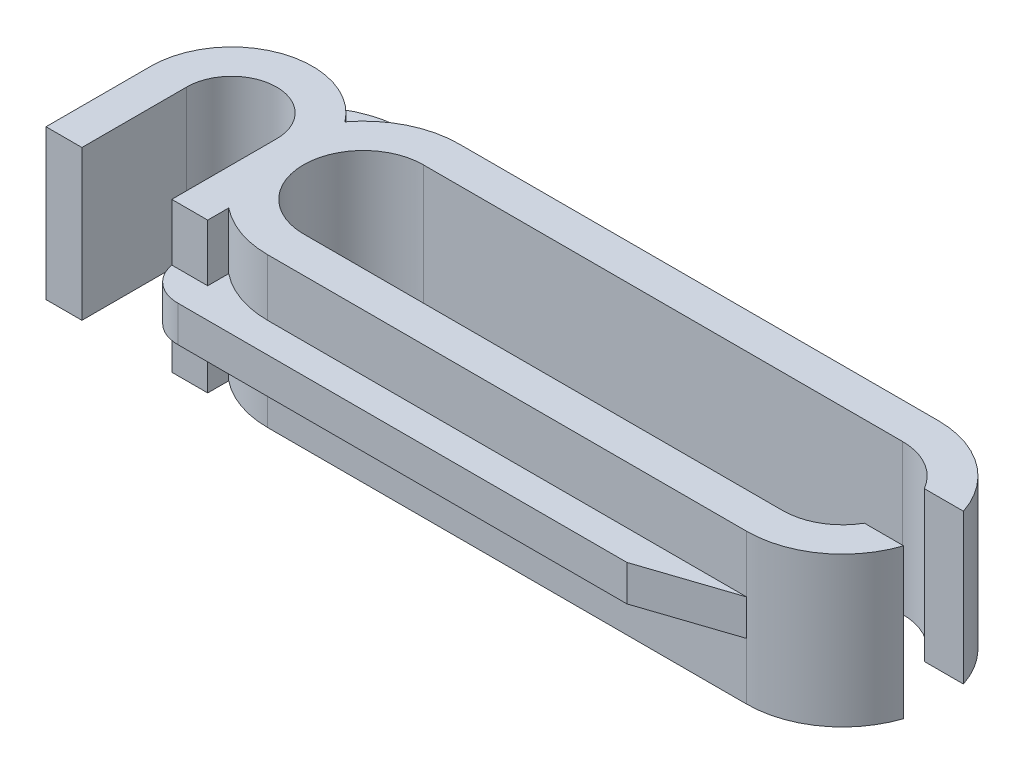
ISO-10303-21;
HEADER;
FILE_DESCRIPTION(('STEP AP214'),'2;1');
FILE_NAME('part.step','',(''),(''),'','','');
FILE_SCHEMA(('AUTOMOTIVE_DESIGN { 1 0 10303 214 1 1 1 1 }'));
ENDSEC;
DATA;
#1=APPLICATION_CONTEXT('core data for automotive mechanical design processes');
#2=APPLICATION_PROTOCOL_DEFINITION('international standard','automotive_design',2000,#1);
#3=PRODUCT_CONTEXT('',#1,'mechanical');
#4=PRODUCT('Part','Part','',(#3));
#5=PRODUCT_RELATED_PRODUCT_CATEGORY('part','',(#4));
#6=PRODUCT_DEFINITION_FORMATION('','',#4);
#7=PRODUCT_DEFINITION_CONTEXT('part definition',#1,'design');
#8=PRODUCT_DEFINITION('design','',#6,#7);
#9=PRODUCT_DEFINITION_SHAPE('','',#8);
#10=(LENGTH_UNIT() NAMED_UNIT(*) SI_UNIT(.MILLI.,.METRE.));
#11=(NAMED_UNIT(*) PLANE_ANGLE_UNIT() SI_UNIT($,.RADIAN.));
#12=(NAMED_UNIT(*) SI_UNIT($,.STERADIAN.) SOLID_ANGLE_UNIT());
#13=UNCERTAINTY_MEASURE_WITH_UNIT(LENGTH_MEASURE(1.E-05),#10,'distance_accuracy_value','');
#14=(GEOMETRIC_REPRESENTATION_CONTEXT(3) GLOBAL_UNCERTAINTY_ASSIGNED_CONTEXT((#13)) GLOBAL_UNIT_ASSIGNED_CONTEXT((#10,
#11,#12)) REPRESENTATION_CONTEXT('',''));
#15=CARTESIAN_POINT('',(0.,0.,0.));
#16=DIRECTION('',(0.,0.,1.));
#17=DIRECTION('',(1.,0.,0.));
#18=AXIS2_PLACEMENT_3D('',#15,#16,#17);
#19=CARTESIAN_POINT('',(-8.,5.,0.));
#20=DIRECTION('',(0.,-1.,0.));
#21=DIRECTION('',(0.,0.,-1.));
#22=AXIS2_PLACEMENT_3D('',#19,#20,#21);
#23=CYLINDRICAL_SURFACE('',#22,3.2);
#24=CARTESIAN_POINT('',(-8.,3.1,0.));
#25=DIRECTION('',(0.,-1.,0.));
#26=DIRECTION('',(0.,0.,-1.));
#27=AXIS2_PLACEMENT_3D('',#24,#25,#26);
#28=CIRCLE('',#27,3.2);
#29=CARTESIAN_POINT('',(-8.,3.1,3.2));
#30=VERTEX_POINT('',#29);
#31=CARTESIAN_POINT('',(-10.,3.1,2.49799919935936));
#32=VERTEX_POINT('',#31);
#33=EDGE_CURVE('E66',#30,#32,#28,.T.);
#34=ORIENTED_EDGE('',*,*,#33,.F.);
#35=DIRECTION('',(0.,-1.,0.));
#36=VECTOR('',#35,1.);
#37=CARTESIAN_POINT('',(-8.,5.,3.2));
#38=LINE('',#37,#36);
#39=CARTESIAN_POINT('',(-8.,5.,3.2));
#40=VERTEX_POINT('',#39);
#41=EDGE_CURVE('E513',#40,#30,#38,.T.);
#42=ORIENTED_EDGE('',*,*,#41,.F.);
#43=CARTESIAN_POINT('',(-8.,5.,0.));
#44=DIRECTION('',(0.,1.,0.));
#45=DIRECTION('',(0.,0.,1.));
#46=AXIS2_PLACEMENT_3D('',#43,#44,#45);
#47=CIRCLE('',#46,3.2);
#48=CARTESIAN_POINT('',(-10.,5.,2.49799919935936));
#49=VERTEX_POINT('',#48);
#50=EDGE_CURVE('E480',#49,#40,#47,.T.);
#51=ORIENTED_EDGE('',*,*,#50,.F.);
#52=DIRECTION('',(0.,-1.,0.));
#53=VECTOR('',#52,1.);
#54=CARTESIAN_POINT('',(-10.,5.,2.49799919935936));
#55=LINE('',#54,#53);
#56=EDGE_CURVE('E419',#49,#32,#55,.T.);
#57=ORIENTED_EDGE('',*,*,#56,.T.);
#58=EDGE_LOOP('',(#34,#42,#51,#57));
#59=FACE_BOUND('',#58,.T.);
#60=ADVANCED_FACE('F43',(#59),#23,.T.);
#61=CARTESIAN_POINT('',(8.,5.,3.2));
#62=DIRECTION('',(0.,0.,-1.));
#63=DIRECTION('',(-1.,0.,0.));
#64=AXIS2_PLACEMENT_3D('',#61,#62,#63);
#65=PLANE('',#64);
#66=DIRECTION('',(-1.,0.,0.));
#67=VECTOR('',#66,1.);
#68=CARTESIAN_POINT('',(-8.,3.1,3.2));
#69=LINE('',#68,#67);
#70=CARTESIAN_POINT('',(8.,3.1,3.2));
#71=VERTEX_POINT('',#70);
#72=EDGE_CURVE('E293',#71,#30,#69,.T.);
#73=ORIENTED_EDGE('',*,*,#72,.F.);
#74=DIRECTION('',(0.,-1.,0.));
#75=VECTOR('',#74,1.);
#76=CARTESIAN_POINT('',(8.,5.,3.2));
#77=LINE('',#76,#75);
#78=CARTESIAN_POINT('',(8.,5.,3.2));
#79=VERTEX_POINT('',#78);
#80=EDGE_CURVE('E509',#79,#71,#77,.T.);
#81=ORIENTED_EDGE('',*,*,#80,.F.);
#82=DIRECTION('',(1.,0.,0.));
#83=VECTOR('',#82,1.);
#84=CARTESIAN_POINT('',(8.,5.,3.2));
#85=LINE('',#84,#83);
#86=EDGE_CURVE('E479',#40,#79,#85,.T.);
#87=ORIENTED_EDGE('',*,*,#86,.F.);
#88=ORIENTED_EDGE('',*,*,#41,.T.);
#89=EDGE_LOOP('',(#73,#81,#87,#88));
#90=FACE_BOUND('',#89,.T.);
#91=ADVANCED_FACE('F593',(#90),#65,.F.);
#92=CARTESIAN_POINT('',(-10.,5.,-0.3));
#93=DIRECTION('',(1.,0.,0.));
#94=DIRECTION('',(0.,0.,-1.));
#95=AXIS2_PLACEMENT_3D('',#92,#93,#94);
#96=PLANE('',#95);
#97=DIRECTION('',(0.,-1.,0.));
#98=VECTOR('',#97,1.);
#99=CARTESIAN_POINT('',(-10.,5.,3.2));
#100=LINE('',#99,#98);
#101=CARTESIAN_POINT('',(-10.,5.,3.2));
#102=VERTEX_POINT('',#101);
#103=CARTESIAN_POINT('',(-10.,3.1,3.2));
#104=VERTEX_POINT('',#103);
#105=EDGE_CURVE('E410',#102,#104,#100,.T.);
#106=ORIENTED_EDGE('',*,*,#105,.T.);
#107=DIRECTION('',(0.,0.,1.));
#108=VECTOR('',#107,1.);
#109=CARTESIAN_POINT('',(-10.,3.1,3.2));
#110=LINE('',#109,#108);
#111=EDGE_CURVE('E587',#32,#104,#110,.T.);
#112=ORIENTED_EDGE('',*,*,#111,.F.);
#113=ORIENTED_EDGE('',*,*,#56,.F.);
#114=DIRECTION('',(0.,0.,1.));
#115=VECTOR('',#114,1.);
#116=CARTESIAN_POINT('',(-10.,5.,-0.3));
#117=LINE('',#116,#115);
#118=EDGE_CURVE('E395',#49,#102,#117,.T.);
#119=ORIENTED_EDGE('',*,*,#118,.T.);
#120=EDGE_LOOP('',(#106,#112,#113,#119));
#121=FACE_BOUND('',#120,.T.);
#122=ADVANCED_FACE('F585',(#121),#96,.T.);
#123=CARTESIAN_POINT('',(-10.,5.,3.2));
#124=DIRECTION('',(0.,0.,1.));
#125=DIRECTION('',(1.,0.,0.));
#126=AXIS2_PLACEMENT_3D('',#123,#124,#125);
#127=PLANE('',#126);
#128=DIRECTION('',(0.,-1.,0.));
#129=VECTOR('',#128,1.);
#130=CARTESIAN_POINT('',(-11.2,5.,3.2));
#131=LINE('',#130,#129);
#132=CARTESIAN_POINT('',(-11.2,5.,3.2));
#133=VERTEX_POINT('',#132);
#134=CARTESIAN_POINT('',(-11.2,3.1,3.2));
#135=VERTEX_POINT('',#134);
#136=EDGE_CURVE('E380',#133,#135,#131,.T.);
#137=ORIENTED_EDGE('',*,*,#136,.T.);
#138=DIRECTION('',(-1.,0.,0.));
#139=VECTOR('',#138,1.);
#140=CARTESIAN_POINT('',(-11.2,3.1,3.2));
#141=LINE('',#140,#139);
#142=EDGE_CURVE('E274',#104,#135,#141,.T.);
#143=ORIENTED_EDGE('',*,*,#142,.F.);
#144=ORIENTED_EDGE('',*,*,#105,.F.);
#145=DIRECTION('',(-1.,0.,0.));
#146=VECTOR('',#145,1.);
#147=CARTESIAN_POINT('',(-10.,5.,3.2));
#148=LINE('',#147,#146);
#149=EDGE_CURVE('E385',#102,#133,#148,.T.);
#150=ORIENTED_EDGE('',*,*,#149,.T.);
#151=EDGE_LOOP('',(#137,#143,#144,#150));
#152=FACE_BOUND('',#151,.T.);
#153=ADVANCED_FACE('F583',(#152),#127,.T.);
#154=CARTESIAN_POINT('',(-8.,1.9,0.));
#155=DIRECTION('',(0.,-1.,0.));
#156=DIRECTION('',(0.,0.,1.));
#157=AXIS2_PLACEMENT_3D('',#154,#155,#156);
#158=CIRCLE('',#157,3.2);
#159=CARTESIAN_POINT('',(-10.5500050071212,1.9,-1.93325488843475));
#160=VERTEX_POINT('',#159);
#161=CARTESIAN_POINT('',(-8.,1.9,-3.2));
#162=VERTEX_POINT('',#161);
#163=EDGE_CURVE('E335',#160,#162,#158,.T.);
#164=ORIENTED_EDGE('',*,*,#163,.T.);
#165=DIRECTION('',(0.,-1.,0.));
#166=VECTOR('',#165,1.);
#167=CARTESIAN_POINT('',(-8.,5.,-3.2));
#168=LINE('',#167,#166);
#169=CARTESIAN_POINT('',(-8.,0.,-3.2));
#170=VERTEX_POINT('',#169);
#171=EDGE_CURVE('E488',#162,#170,#168,.T.);
#172=ORIENTED_EDGE('',*,*,#171,.T.);
#173=CARTESIAN_POINT('',(-8.,0.,0.));
#174=DIRECTION('',(0.,1.,0.));
#175=DIRECTION('',(0.,0.,1.));
#176=AXIS2_PLACEMENT_3D('',#173,#174,#175);
#177=CIRCLE('',#176,3.2);
#178=CARTESIAN_POINT('',(-10.5500050071212,0.,-1.93325488843475));
#179=VERTEX_POINT('',#178);
#180=EDGE_CURVE('E489',#170,#179,#177,.T.);
#181=ORIENTED_EDGE('',*,*,#180,.T.);
#182=DIRECTION('',(0.,-1.,0.));
#183=VECTOR('',#182,1.);
#184=CARTESIAN_POINT('',(-10.5500050071212,2.5,-1.93325488843475));
#185=LINE('',#184,#183);
#186=EDGE_CURVE('E422',#179,#160,#185,.F.);
#187=ORIENTED_EDGE('',*,*,#186,.T.);
#188=EDGE_LOOP('',(#164,#172,#181,#187));
#189=FACE_BOUND('',#188,.T.);
#190=ADVANCED_FACE('F601',(#189),#23,.T.);
#191=CARTESIAN_POINT('',(-8.,5.,-3.2));
#192=DIRECTION('',(0.,0.,1.));
#193=DIRECTION('',(1.,0.,0.));
#194=AXIS2_PLACEMENT_3D('',#191,#192,#193);
#195=PLANE('',#194);
#196=DIRECTION('',(1.,0.,0.));
#197=VECTOR('',#196,1.);
#198=CARTESIAN_POINT('',(8.,1.9,-3.2));
#199=LINE('',#198,#197);
#200=CARTESIAN_POINT('',(8.,1.9,-3.2));
#201=VERTEX_POINT('',#200);
#202=EDGE_CURVE('E338',#162,#201,#199,.T.);
#203=ORIENTED_EDGE('',*,*,#202,.T.);
#204=DIRECTION('',(0.,-1.,0.));
#205=VECTOR('',#204,1.);
#206=CARTESIAN_POINT('',(8.,5.,-3.2));
#207=LINE('',#206,#205);
#208=CARTESIAN_POINT('',(8.,0.,-3.2));
#209=VERTEX_POINT('',#208);
#210=EDGE_CURVE('E504',#201,#209,#207,.T.);
#211=ORIENTED_EDGE('',*,*,#210,.T.);
#212=DIRECTION('',(-1.,0.,0.));
#213=VECTOR('',#212,1.);
#214=CARTESIAN_POINT('',(-8.,0.,-3.2));
#215=LINE('',#214,#213);
#216=EDGE_CURVE('E498',#209,#170,#215,.T.);
#217=ORIENTED_EDGE('',*,*,#216,.T.);
#218=ORIENTED_EDGE('',*,*,#171,.F.);
#219=EDGE_LOOP('',(#203,#211,#217,#218));
#220=FACE_BOUND('',#219,.T.);
#221=ADVANCED_FACE('F607',(#220),#195,.F.);
#222=DIRECTION('',(0.,-1.,0.));
#223=VECTOR('',#222,1.);
#224=CARTESIAN_POINT('',(-14.2,5.,3.2));
#225=LINE('',#224,#223);
#226=CARTESIAN_POINT('',(-14.2,5.,3.2));
#227=VERTEX_POINT('',#226);
#228=CARTESIAN_POINT('',(-14.2,0.,3.2));
#229=VERTEX_POINT('',#228);
#230=EDGE_CURVE('E378',#227,#229,#225,.T.);
#231=ORIENTED_EDGE('',*,*,#230,.F.);
#232=CARTESIAN_POINT('',(-15.4,5.,3.2));
#233=VERTEX_POINT('',#232);
#234=EDGE_CURVE('E389',#227,#233,#148,.T.);
#235=ORIENTED_EDGE('',*,*,#234,.T.);
#236=DIRECTION('',(0.,-1.,0.));
#237=VECTOR('',#236,1.);
#238=CARTESIAN_POINT('',(-15.4,5.,3.2));
#239=LINE('',#238,#237);
#240=CARTESIAN_POINT('',(-15.4,0.,3.2));
#241=VERTEX_POINT('',#240);
#242=EDGE_CURVE('E397',#233,#241,#239,.T.);
#243=ORIENTED_EDGE('',*,*,#242,.T.);
#244=DIRECTION('',(-1.,0.,0.));
#245=VECTOR('',#244,1.);
#246=CARTESIAN_POINT('',(-10.,0.,3.2));
#247=LINE('',#246,#245);
#248=EDGE_CURVE('E377',#229,#241,#247,.T.);
#249=ORIENTED_EDGE('',*,*,#248,.F.);
#250=EDGE_LOOP('',(#231,#235,#243,#249));
#251=FACE_BOUND('',#250,.T.);
#252=ADVANCED_FACE('F568',(#251),#127,.T.);
#253=CARTESIAN_POINT('',(-8.,1.9,3.2));
#254=VERTEX_POINT('',#253);
#255=CARTESIAN_POINT('',(-8.,0.,3.2));
#256=VERTEX_POINT('',#255);
#257=EDGE_CURVE('E512',#254,#256,#38,.T.);
#258=ORIENTED_EDGE('',*,*,#257,.F.);
#259=CARTESIAN_POINT('',(-8.,1.9,0.));
#260=DIRECTION('',(0.,-1.,0.));
#261=DIRECTION('',(0.,0.,-1.));
#262=AXIS2_PLACEMENT_3D('',#259,#260,#261);
#263=CIRCLE('',#262,3.2);
#264=CARTESIAN_POINT('',(-10.,1.9,2.49799919935936));
#265=VERTEX_POINT('',#264);
#266=EDGE_CURVE('E300',#254,#265,#263,.T.);
#267=ORIENTED_EDGE('',*,*,#266,.T.);
#268=CARTESIAN_POINT('',(-10.,0.,2.49799919935936));
#269=VERTEX_POINT('',#268);
#270=EDGE_CURVE('E413',#265,#269,#55,.T.);
#271=ORIENTED_EDGE('',*,*,#270,.T.);
#272=EDGE_CURVE('E468',#269,#256,#177,.T.);
#273=ORIENTED_EDGE('',*,*,#272,.T.);
#274=EDGE_LOOP('',(#258,#267,#271,#273));
#275=FACE_BOUND('',#274,.T.);
#276=ADVANCED_FACE('F609',(#275),#23,.T.);
#277=CARTESIAN_POINT('',(8.,5.,0.));
#278=DIRECTION('',(0.,-1.,0.));
#279=DIRECTION('',(0.,0.,-1.));
#280=AXIS2_PLACEMENT_3D('',#277,#278,#279);
#281=CYLINDRICAL_SURFACE('',#280,3.2);
#282=CARTESIAN_POINT('',(8.,0.,0.));
#283=DIRECTION('',(0.,1.,0.));
#284=DIRECTION('',(0.,0.,-1.));
#285=AXIS2_PLACEMENT_3D('',#282,#283,#284);
#286=CIRCLE('',#285,3.2);
#287=CARTESIAN_POINT('',(8.,0.,3.2));
#288=VERTEX_POINT('',#287);
#289=CARTESIAN_POINT('',(11.0397368307141,0.,1.));
#290=VERTEX_POINT('',#289);
#291=EDGE_CURVE('E495',#288,#290,#286,.T.);
#292=ORIENTED_EDGE('',*,*,#291,.T.);
#293=DIRECTION('',(0.,-1.,0.));
#294=VECTOR('',#293,1.);
#295=CARTESIAN_POINT('',(11.0397368307141,5.,1.));
#296=LINE('',#295,#294);
#297=CARTESIAN_POINT('',(11.0397368307141,5.,1.));
#298=VERTEX_POINT('',#297);
#299=EDGE_CURVE('E438',#290,#298,#296,.F.);
#300=ORIENTED_EDGE('',*,*,#299,.T.);
#301=CARTESIAN_POINT('',(8.,5.,0.));
#302=DIRECTION('',(0.,1.,0.));
#303=DIRECTION('',(0.,0.,-1.));
#304=AXIS2_PLACEMENT_3D('',#301,#302,#303);
#305=CIRCLE('',#304,3.2);
#306=EDGE_CURVE('E483',#79,#298,#305,.T.);
#307=ORIENTED_EDGE('',*,*,#306,.F.);
#308=ORIENTED_EDGE('',*,*,#80,.T.);
#309=DIRECTION('',(0.,-1.,0.));
#310=VECTOR('',#309,1.);
#311=CARTESIAN_POINT('',(8.,3.1,3.2));
#312=LINE('',#311,#310);
#313=CARTESIAN_POINT('',(8.,1.9,3.2));
#314=VERTEX_POINT('',#313);
#315=EDGE_CURVE('E299',#71,#314,#312,.T.);
#316=ORIENTED_EDGE('',*,*,#315,.T.);
#317=EDGE_CURVE('E508',#314,#288,#77,.T.);
#318=ORIENTED_EDGE('',*,*,#317,.T.);
#319=EDGE_LOOP('',(#292,#300,#307,#308,#316,#318));
#320=FACE_BOUND('',#319,.T.);
#321=ADVANCED_FACE('F597',(#320),#281,.T.);
#322=CARTESIAN_POINT('',(8.,0.,0.));
#323=DIRECTION('',(0.,1.,0.));
#324=DIRECTION('',(0.,0.,1.));
#325=AXIS2_PLACEMENT_3D('',#322,#323,#324);
#326=CYLINDRICAL_SURFACE('',#325,2.);
#327=CARTESIAN_POINT('',(8.,5.,0.));
#328=DIRECTION('',(0.,1.,0.));
#329=DIRECTION('',(0.,0.,-1.));
#330=AXIS2_PLACEMENT_3D('',#327,#328,#329);
#331=CIRCLE('',#330,2.);
#332=CARTESIAN_POINT('',(8.,5.,2.));
#333=VERTEX_POINT('',#332);
#334=CARTESIAN_POINT('',(9.73205080756888,5.,1.));
#335=VERTEX_POINT('',#334);
#336=EDGE_CURVE('E461',#333,#335,#331,.T.);
#337=ORIENTED_EDGE('',*,*,#336,.T.);
#338=DIRECTION('',(0.,1.,0.));
#339=VECTOR('',#338,1.);
#340=CARTESIAN_POINT('',(9.73205080756888,0.,1.));
#341=LINE('',#340,#339);
#342=CARTESIAN_POINT('',(9.73205080756888,0.,1.));
#343=VERTEX_POINT('',#342);
#344=EDGE_CURVE('E11',#335,#343,#341,.F.);
#345=ORIENTED_EDGE('',*,*,#344,.T.);
#346=CARTESIAN_POINT('',(8.,0.,0.));
#347=DIRECTION('',(0.,1.,0.));
#348=DIRECTION('',(0.,0.,-1.));
#349=AXIS2_PLACEMENT_3D('',#346,#347,#348);
#350=CIRCLE('',#349,2.);
#351=CARTESIAN_POINT('',(8.,0.,2.));
#352=VERTEX_POINT('',#351);
#353=EDGE_CURVE('E449',#352,#343,#350,.T.);
#354=ORIENTED_EDGE('',*,*,#353,.F.);
#355=DIRECTION('',(0.,1.,0.));
#356=VECTOR('',#355,1.);
#357=CARTESIAN_POINT('',(8.,0.,2.));
#358=LINE('',#357,#356);
#359=EDGE_CURVE('E472',#352,#333,#358,.T.);
#360=ORIENTED_EDGE('',*,*,#359,.T.);
#361=EDGE_LOOP('',(#337,#345,#354,#360));
#362=FACE_BOUND('',#361,.T.);
#363=ADVANCED_FACE('F611',(#362),#326,.F.);
#364=CARTESIAN_POINT('',(-8.,5.,-3.2));
#365=VERTEX_POINT('',#364);
#366=CARTESIAN_POINT('',(-8.,3.1,-3.2));
#367=VERTEX_POINT('',#366);
#368=EDGE_CURVE('E501',#365,#367,#168,.T.);
#369=ORIENTED_EDGE('',*,*,#368,.T.);
#370=CARTESIAN_POINT('',(-8.,3.1,0.));
#371=DIRECTION('',(0.,-1.,0.));
#372=DIRECTION('',(0.,0.,1.));
#373=AXIS2_PLACEMENT_3D('',#370,#371,#372);
#374=CIRCLE('',#373,3.2);
#375=CARTESIAN_POINT('',(-10.5500050071212,3.1,-1.93325488843476));
#376=VERTEX_POINT('',#375);
#377=EDGE_CURVE('E321',#376,#367,#374,.T.);
#378=ORIENTED_EDGE('',*,*,#377,.F.);
#379=CARTESIAN_POINT('',(-10.5500050071212,5.,-1.93325488843475));
#380=VERTEX_POINT('',#379);
#381=EDGE_CURVE('E421',#376,#380,#185,.F.);
#382=ORIENTED_EDGE('',*,*,#381,.T.);
#383=EDGE_CURVE('E476',#365,#380,#47,.T.);
#384=ORIENTED_EDGE('',*,*,#383,.F.);
#385=EDGE_LOOP('',(#369,#378,#382,#384));
#386=FACE_BOUND('',#385,.T.);
#387=ADVANCED_FACE('F45',(#386),#23,.T.);
#388=ORIENTED_EDGE('',*,*,#317,.F.);
#389=DIRECTION('',(-1.,0.,0.));
#390=VECTOR('',#389,1.);
#391=CARTESIAN_POINT('',(-8.,1.9,3.2));
#392=LINE('',#391,#390);
#393=EDGE_CURVE('E58',#314,#254,#392,.T.);
#394=ORIENTED_EDGE('',*,*,#393,.T.);
#395=ORIENTED_EDGE('',*,*,#257,.T.);
#396=DIRECTION('',(1.,0.,0.));
#397=VECTOR('',#396,1.);
#398=CARTESIAN_POINT('',(8.,0.,3.2));
#399=LINE('',#398,#397);
#400=EDGE_CURVE('E491',#256,#288,#399,.T.);
#401=ORIENTED_EDGE('',*,*,#400,.T.);
#402=EDGE_LOOP('',(#388,#394,#395,#401));
#403=FACE_BOUND('',#402,.T.);
#404=ADVANCED_FACE('F605',(#403),#65,.F.);
#405=CARTESIAN_POINT('',(11.0397368307141,5.,-1.));
#406=VERTEX_POINT('',#405);
#407=CARTESIAN_POINT('',(8.,5.,-3.2));
#408=VERTEX_POINT('',#407);
#409=EDGE_CURVE('E482',#406,#408,#305,.T.);
#410=ORIENTED_EDGE('',*,*,#409,.F.);
#411=DIRECTION('',(0.,-1.,0.));
#412=VECTOR('',#411,1.);
#413=CARTESIAN_POINT('',(11.0397368307141,5.,-1.));
#414=LINE('',#413,#412);
#415=CARTESIAN_POINT('',(11.0397368307141,0.,-1.));
#416=VERTEX_POINT('',#415);
#417=EDGE_CURVE('E433',#406,#416,#414,.T.);
#418=ORIENTED_EDGE('',*,*,#417,.T.);
#419=EDGE_CURVE('E494',#416,#209,#286,.T.);
#420=ORIENTED_EDGE('',*,*,#419,.T.);
#421=ORIENTED_EDGE('',*,*,#210,.F.);
#422=DIRECTION('',(0.,-1.,0.));
#423=VECTOR('',#422,1.);
#424=CARTESIAN_POINT('',(8.,3.1,-3.2));
#425=LINE('',#424,#423);
#426=CARTESIAN_POINT('',(8.,3.1,-3.2));
#427=VERTEX_POINT('',#426);
#428=EDGE_CURVE('E354',#427,#201,#425,.T.);
#429=ORIENTED_EDGE('',*,*,#428,.F.);
#430=EDGE_CURVE('E505',#408,#427,#207,.T.);
#431=ORIENTED_EDGE('',*,*,#430,.F.);
#432=EDGE_LOOP('',(#410,#418,#420,#421,#429,#431));
#433=FACE_BOUND('',#432,.T.);
#434=ADVANCED_FACE('F541',(#433),#281,.T.);
#435=ORIENTED_EDGE('',*,*,#430,.T.);
#436=DIRECTION('',(1.,0.,0.));
#437=VECTOR('',#436,1.);
#438=CARTESIAN_POINT('',(8.,3.1,-3.2));
#439=LINE('',#438,#437);
#440=EDGE_CURVE('E324',#367,#427,#439,.T.);
#441=ORIENTED_EDGE('',*,*,#440,.F.);
#442=ORIENTED_EDGE('',*,*,#368,.F.);
#443=DIRECTION('',(-1.,0.,0.));
#444=VECTOR('',#443,1.);
#445=CARTESIAN_POINT('',(-8.,5.,-3.2));
#446=LINE('',#445,#444);
#447=EDGE_CURVE('E486',#408,#365,#446,.T.);
#448=ORIENTED_EDGE('',*,*,#447,.F.);
#449=EDGE_LOOP('',(#435,#441,#442,#448));
#450=FACE_BOUND('',#449,.T.);
#451=ADVANCED_FACE('F551',(#450),#195,.F.);
#452=CARTESIAN_POINT('',(-8.,5.,0.));
#453=DIRECTION('',(0.,1.,0.));
#454=DIRECTION('',(0.,0.,1.));
#455=AXIS2_PLACEMENT_3D('',#452,#453,#454);
#456=PLANE('',#455);
#457=DIRECTION('',(0.,0.,-1.));
#458=VECTOR('',#457,1.);
#459=CARTESIAN_POINT('',(-14.2,5.,-0.3));
#460=LINE('',#459,#458);
#461=CARTESIAN_POINT('',(-14.2,5.,-0.3));
#462=VERTEX_POINT('',#461);
#463=EDGE_CURVE('E364',#227,#462,#460,.T.);
#464=ORIENTED_EDGE('',*,*,#463,.T.);
#465=CARTESIAN_POINT('',(-12.7,5.,-0.3));
#466=DIRECTION('',(0.,-1.,0.));
#467=DIRECTION('',(0.,0.,1.));
#468=AXIS2_PLACEMENT_3D('',#465,#466,#467);
#469=CIRCLE('',#468,1.5);
#470=CARTESIAN_POINT('',(-11.2,5.,-0.3));
#471=VERTEX_POINT('',#470);
#472=EDGE_CURVE('E357',#462,#471,#469,.T.);
#473=ORIENTED_EDGE('',*,*,#472,.T.);
#474=DIRECTION('',(0.,0.,1.));
#475=VECTOR('',#474,1.);
#476=CARTESIAN_POINT('',(-11.2,5.,-0.3));
#477=LINE('',#476,#475);
#478=EDGE_CURVE('E360',#471,#133,#477,.T.);
#479=ORIENTED_EDGE('',*,*,#478,.T.);
#480=ORIENTED_EDGE('',*,*,#149,.F.);
#481=ORIENTED_EDGE('',*,*,#118,.F.);
#482=ORIENTED_EDGE('',*,*,#50,.T.);
#483=ORIENTED_EDGE('',*,*,#86,.T.);
#484=ORIENTED_EDGE('',*,*,#306,.T.);
#485=DIRECTION('',(1.,0.,0.));
#486=VECTOR('',#485,1.);
#487=CARTESIAN_POINT('',(8.5,5.,1.));
#488=LINE('',#487,#486);
#489=EDGE_CURVE('E425',#335,#298,#488,.T.);
#490=ORIENTED_EDGE('',*,*,#489,.F.);
#491=ORIENTED_EDGE('',*,*,#336,.F.);
#492=DIRECTION('',(1.,0.,0.));
#493=VECTOR('',#492,1.);
#494=CARTESIAN_POINT('',(8.,5.,2.));
#495=LINE('',#494,#493);
#496=CARTESIAN_POINT('',(-8.,5.,2.));
#497=VERTEX_POINT('',#496);
#498=EDGE_CURVE('E457',#497,#333,#495,.T.);
#499=ORIENTED_EDGE('',*,*,#498,.F.);
#500=CARTESIAN_POINT('',(-8.,5.,0.));
#501=DIRECTION('',(0.,1.,0.));
#502=DIRECTION('',(0.,0.,1.));
#503=AXIS2_PLACEMENT_3D('',#500,#501,#502);
#504=CIRCLE('',#503,2.);
#505=CARTESIAN_POINT('',(-8.,5.,-2.));
#506=VERTEX_POINT('',#505);
#507=EDGE_CURVE('E441',#506,#497,#504,.T.);
#508=ORIENTED_EDGE('',*,*,#507,.F.);
#509=DIRECTION('',(-1.,0.,0.));
#510=VECTOR('',#509,1.);
#511=CARTESIAN_POINT('',(-8.,5.,-2.));
#512=LINE('',#511,#510);
#513=CARTESIAN_POINT('',(8.,5.,-2.));
#514=VERTEX_POINT('',#513);
#515=EDGE_CURVE('E445',#514,#506,#512,.T.);
#516=ORIENTED_EDGE('',*,*,#515,.F.);
#517=CARTESIAN_POINT('',(9.73205080756888,5.,-1.));
#518=VERTEX_POINT('',#517);
#519=EDGE_CURVE('E460',#518,#514,#331,.T.);
#520=ORIENTED_EDGE('',*,*,#519,.F.);
#521=DIRECTION('',(-1.,0.,0.));
#522=VECTOR('',#521,1.);
#523=CARTESIAN_POINT('',(8.5,5.,-1.));
#524=LINE('',#523,#522);
#525=EDGE_CURVE('E430',#406,#518,#524,.T.);
#526=ORIENTED_EDGE('',*,*,#525,.F.);
#527=ORIENTED_EDGE('',*,*,#409,.T.);
#528=ORIENTED_EDGE('',*,*,#447,.T.);
#529=ORIENTED_EDGE('',*,*,#383,.T.);
#530=CARTESIAN_POINT('',(-12.7,5.,-0.3));
#531=DIRECTION('',(0.,-1.,0.));
#532=DIRECTION('',(0.,0.,-1.));
#533=AXIS2_PLACEMENT_3D('',#530,#531,#532);
#534=CIRCLE('',#533,2.7);
#535=CARTESIAN_POINT('',(-15.4,5.,-0.3));
#536=VERTEX_POINT('',#535);
#537=EDGE_CURVE('E392',#536,#380,#534,.T.);
#538=ORIENTED_EDGE('',*,*,#537,.F.);
#539=DIRECTION('',(0.,0.,-1.));
#540=VECTOR('',#539,1.);
#541=CARTESIAN_POINT('',(-15.4,5.,3.2));
#542=LINE('',#541,#540);
#543=EDGE_CURVE('E388',#233,#536,#542,.T.);
#544=ORIENTED_EDGE('',*,*,#543,.F.);
#545=ORIENTED_EDGE('',*,*,#234,.F.);
#546=EDGE_LOOP('',(#464,#473,#479,#480,#481,#482,#483,#484,#490,#491,#499,#508,#516,#520,#526,
#527,#528,#529,#538,#544,#545));
#547=FACE_BOUND('',#546,.T.);
#548=ADVANCED_FACE('F524',(#547),#456,.T.);
#549=CARTESIAN_POINT('',(-8.,0.,0.));
#550=DIRECTION('',(0.,1.,0.));
#551=DIRECTION('',(0.,0.,1.));
#552=AXIS2_PLACEMENT_3D('',#549,#550,#551);
#553=PLANE('',#552);
#554=CARTESIAN_POINT('',(-12.7,0.,-0.3));
#555=DIRECTION('',(0.,-1.,0.));
#556=DIRECTION('',(0.,0.,1.));
#557=AXIS2_PLACEMENT_3D('',#554,#555,#556);
#558=CIRCLE('',#557,1.5);
#559=CARTESIAN_POINT('',(-14.2,0.,-0.3));
#560=VERTEX_POINT('',#559);
#561=CARTESIAN_POINT('',(-11.2,0.,-0.3));
#562=VERTEX_POINT('',#561);
#563=EDGE_CURVE('E356',#560,#562,#558,.T.);
#564=ORIENTED_EDGE('',*,*,#563,.F.);
#565=DIRECTION('',(0.,0.,-1.));
#566=VECTOR('',#565,1.);
#567=CARTESIAN_POINT('',(-14.2,0.,-0.3));
#568=LINE('',#567,#566);
#569=EDGE_CURVE('E361',#229,#560,#568,.T.);
#570=ORIENTED_EDGE('',*,*,#569,.F.);
#571=ORIENTED_EDGE('',*,*,#248,.T.);
#572=DIRECTION('',(0.,0.,-1.));
#573=VECTOR('',#572,1.);
#574=CARTESIAN_POINT('',(-15.4,0.,3.2));
#575=LINE('',#574,#573);
#576=CARTESIAN_POINT('',(-15.4,0.,-0.3));
#577=VERTEX_POINT('',#576);
#578=EDGE_CURVE('E401',#241,#577,#575,.T.);
#579=ORIENTED_EDGE('',*,*,#578,.T.);
#580=CARTESIAN_POINT('',(-12.7,0.,-0.3));
#581=DIRECTION('',(0.,-1.,0.));
#582=DIRECTION('',(0.,0.,-1.));
#583=AXIS2_PLACEMENT_3D('',#580,#581,#582);
#584=CIRCLE('',#583,2.7);
#585=EDGE_CURVE('E404',#577,#179,#584,.T.);
#586=ORIENTED_EDGE('',*,*,#585,.T.);
#587=ORIENTED_EDGE('',*,*,#180,.F.);
#588=ORIENTED_EDGE('',*,*,#216,.F.);
#589=ORIENTED_EDGE('',*,*,#419,.F.);
#590=DIRECTION('',(-1.,0.,0.));
#591=VECTOR('',#590,1.);
#592=CARTESIAN_POINT('',(8.5,0.,-1.));
#593=LINE('',#592,#591);
#594=CARTESIAN_POINT('',(9.73205080756888,0.,-1.));
#595=VERTEX_POINT('',#594);
#596=EDGE_CURVE('E429',#416,#595,#593,.T.);
#597=ORIENTED_EDGE('',*,*,#596,.T.);
#598=CARTESIAN_POINT('',(8.,0.,-2.));
#599=VERTEX_POINT('',#598);
#600=EDGE_CURVE('E448',#595,#599,#350,.T.);
#601=ORIENTED_EDGE('',*,*,#600,.T.);
#602=DIRECTION('',(-1.,0.,0.));
#603=VECTOR('',#602,1.);
#604=CARTESIAN_POINT('',(-8.,0.,-2.));
#605=LINE('',#604,#603);
#606=CARTESIAN_POINT('',(-8.,0.,-2.));
#607=VERTEX_POINT('',#606);
#608=EDGE_CURVE('E452',#599,#607,#605,.T.);
#609=ORIENTED_EDGE('',*,*,#608,.T.);
#610=CARTESIAN_POINT('',(-8.,0.,0.));
#611=DIRECTION('',(0.,1.,0.));
#612=DIRECTION('',(0.,0.,1.));
#613=AXIS2_PLACEMENT_3D('',#610,#611,#612);
#614=CIRCLE('',#613,2.);
#615=CARTESIAN_POINT('',(-8.,0.,2.));
#616=VERTEX_POINT('',#615);
#617=EDGE_CURVE('E442',#607,#616,#614,.T.);
#618=ORIENTED_EDGE('',*,*,#617,.T.);
#619=DIRECTION('',(1.,0.,0.));
#620=VECTOR('',#619,1.);
#621=CARTESIAN_POINT('',(8.,0.,2.));
#622=LINE('',#621,#620);
#623=EDGE_CURVE('E444',#616,#352,#622,.T.);
#624=ORIENTED_EDGE('',*,*,#623,.T.);
#625=ORIENTED_EDGE('',*,*,#353,.T.);
#626=DIRECTION('',(1.,0.,0.));
#627=VECTOR('',#626,1.);
#628=CARTESIAN_POINT('',(8.5,0.,1.));
#629=LINE('',#628,#627);
#630=EDGE_CURVE('E426',#343,#290,#629,.T.);
#631=ORIENTED_EDGE('',*,*,#630,.T.);
#632=ORIENTED_EDGE('',*,*,#291,.F.);
#633=ORIENTED_EDGE('',*,*,#400,.F.);
#634=ORIENTED_EDGE('',*,*,#272,.F.);
#635=DIRECTION('',(0.,0.,1.));
#636=VECTOR('',#635,1.);
#637=CARTESIAN_POINT('',(-10.,0.,-0.3));
#638=LINE('',#637,#636);
#639=CARTESIAN_POINT('',(-10.,0.,3.2));
#640=VERTEX_POINT('',#639);
#641=EDGE_CURVE('E407',#269,#640,#638,.T.);
#642=ORIENTED_EDGE('',*,*,#641,.T.);
#643=CARTESIAN_POINT('',(-11.2,0.,3.2));
#644=VERTEX_POINT('',#643);
#645=EDGE_CURVE('E398',#640,#644,#247,.T.);
#646=ORIENTED_EDGE('',*,*,#645,.T.);
#647=DIRECTION('',(0.,0.,1.));
#648=VECTOR('',#647,1.);
#649=CARTESIAN_POINT('',(-11.2,0.,-0.3));
#650=LINE('',#649,#648);
#651=EDGE_CURVE('E370',#562,#644,#650,.T.);
#652=ORIENTED_EDGE('',*,*,#651,.F.);
#653=EDGE_LOOP('',(#564,#570,#571,#579,#586,#587,#588,#589,#597,#601,#609,#618,#624,#625,#631,
#632,#633,#634,#642,#646,#652));
#654=FACE_BOUND('',#653,.T.);
#655=ADVANCED_FACE('F534',(#654),#553,.F.);
#656=CARTESIAN_POINT('',(-8.,0.,0.));
#657=DIRECTION('',(0.,1.,0.));
#658=DIRECTION('',(0.,0.,1.));
#659=AXIS2_PLACEMENT_3D('',#656,#657,#658);
#660=CYLINDRICAL_SURFACE('',#659,2.);
#661=ORIENTED_EDGE('',*,*,#507,.T.);
#662=DIRECTION('',(0.,1.,0.));
#663=VECTOR('',#662,1.);
#664=CARTESIAN_POINT('',(-8.,0.,2.));
#665=LINE('',#664,#663);
#666=EDGE_CURVE('E455',#616,#497,#665,.T.);
#667=ORIENTED_EDGE('',*,*,#666,.F.);
#668=ORIENTED_EDGE('',*,*,#617,.F.);
#669=DIRECTION('',(0.,1.,0.));
#670=VECTOR('',#669,1.);
#671=CARTESIAN_POINT('',(-8.,0.,-2.));
#672=LINE('',#671,#670);
#673=EDGE_CURVE('E466',#607,#506,#672,.T.);
#674=ORIENTED_EDGE('',*,*,#673,.T.);
#675=EDGE_LOOP('',(#661,#667,#668,#674));
#676=FACE_BOUND('',#675,.T.);
#677=ADVANCED_FACE('F651',(#676),#660,.F.);
#678=CARTESIAN_POINT('',(-8.,0.,-2.));
#679=DIRECTION('',(0.,0.,-1.));
#680=DIRECTION('',(-1.,0.,0.));
#681=AXIS2_PLACEMENT_3D('',#678,#679,#680);
#682=PLANE('',#681);
#683=ORIENTED_EDGE('',*,*,#515,.T.);
#684=ORIENTED_EDGE('',*,*,#673,.F.);
#685=ORIENTED_EDGE('',*,*,#608,.F.);
#686=DIRECTION('',(0.,1.,0.));
#687=VECTOR('',#686,1.);
#688=CARTESIAN_POINT('',(8.,0.,-2.));
#689=LINE('',#688,#687);
#690=EDGE_CURVE('E469',#599,#514,#689,.T.);
#691=ORIENTED_EDGE('',*,*,#690,.T.);
#692=EDGE_LOOP('',(#683,#684,#685,#691));
#693=FACE_BOUND('',#692,.T.);
#694=ADVANCED_FACE('F529',(#693),#682,.F.);
#695=ORIENTED_EDGE('',*,*,#600,.F.);
#696=DIRECTION('',(0.,1.,0.));
#697=VECTOR('',#696,1.);
#698=CARTESIAN_POINT('',(9.73205080756888,0.,-1.));
#699=LINE('',#698,#697);
#700=EDGE_CURVE('E51',#595,#518,#699,.T.);
#701=ORIENTED_EDGE('',*,*,#700,.T.);
#702=ORIENTED_EDGE('',*,*,#519,.T.);
#703=ORIENTED_EDGE('',*,*,#690,.F.);
#704=EDGE_LOOP('',(#695,#701,#702,#703));
#705=FACE_BOUND('',#704,.T.);
#706=ADVANCED_FACE('F518',(#705),#326,.F.);
#707=CARTESIAN_POINT('',(8.,0.,2.));
#708=DIRECTION('',(0.,0.,1.));
#709=DIRECTION('',(1.,0.,0.));
#710=AXIS2_PLACEMENT_3D('',#707,#708,#709);
#711=PLANE('',#710);
#712=ORIENTED_EDGE('',*,*,#498,.T.);
#713=ORIENTED_EDGE('',*,*,#359,.F.);
#714=ORIENTED_EDGE('',*,*,#623,.F.);
#715=ORIENTED_EDGE('',*,*,#666,.T.);
#716=EDGE_LOOP('',(#712,#713,#714,#715));
#717=FACE_BOUND('',#716,.T.);
#718=ADVANCED_FACE('F648',(#717),#711,.F.);
#719=CARTESIAN_POINT('',(8.5,0.,-1.));
#720=DIRECTION('',(0.,0.,-1.));
#721=DIRECTION('',(-1.,0.,0.));
#722=AXIS2_PLACEMENT_3D('',#719,#720,#721);
#723=PLANE('',#722);
#724=ORIENTED_EDGE('',*,*,#525,.T.);
#725=ORIENTED_EDGE('',*,*,#700,.F.);
#726=ORIENTED_EDGE('',*,*,#596,.F.);
#727=ORIENTED_EDGE('',*,*,#417,.F.);
#728=EDGE_LOOP('',(#724,#725,#726,#727));
#729=FACE_BOUND('',#728,.T.);
#730=ADVANCED_FACE('F539',(#729),#723,.F.);
#731=CARTESIAN_POINT('',(8.5,0.,1.));
#732=DIRECTION('',(0.,0.,1.));
#733=DIRECTION('',(1.,0.,0.));
#734=AXIS2_PLACEMENT_3D('',#731,#732,#733);
#735=PLANE('',#734);
#736=ORIENTED_EDGE('',*,*,#630,.F.);
#737=ORIENTED_EDGE('',*,*,#344,.F.);
#738=ORIENTED_EDGE('',*,*,#489,.T.);
#739=ORIENTED_EDGE('',*,*,#299,.F.);
#740=EDGE_LOOP('',(#736,#737,#738,#739));
#741=FACE_BOUND('',#740,.T.);
#742=ADVANCED_FACE('F645',(#741),#735,.F.);
#743=CARTESIAN_POINT('',(-12.7,5.,-0.3));
#744=DIRECTION('',(0.,-1.,0.));
#745=DIRECTION('',(0.,0.,-1.));
#746=AXIS2_PLACEMENT_3D('',#743,#744,#745);
#747=CYLINDRICAL_SURFACE('',#746,2.7);
#748=CARTESIAN_POINT('',(-12.7,3.1,-0.3));
#749=DIRECTION('',(0.,-1.,0.));
#750=DIRECTION('',(0.,0.,1.));
#751=AXIS2_PLACEMENT_3D('',#748,#749,#750);
#752=CIRCLE('',#751,2.7);
#753=CARTESIAN_POINT('',(-14.2,3.1,-2.54499443206436));
#754=VERTEX_POINT('',#753);
#755=EDGE_CURVE('E319',#754,#376,#752,.T.);
#756=ORIENTED_EDGE('',*,*,#755,.F.);
#757=DIRECTION('',(0.,-1.,0.));
#758=VECTOR('',#757,1.);
#759=CARTESIAN_POINT('',(-14.2,3.1,-2.54499443206436));
#760=LINE('',#759,#758);
#761=CARTESIAN_POINT('',(-14.2,1.9,-2.54499443206436));
#762=VERTEX_POINT('',#761);
#763=EDGE_CURVE('E332',#754,#762,#760,.T.);
#764=ORIENTED_EDGE('',*,*,#763,.T.);
#765=CARTESIAN_POINT('',(-12.7,1.9,-0.3));
#766=DIRECTION('',(0.,-1.,0.));
#767=DIRECTION('',(0.,0.,1.));
#768=AXIS2_PLACEMENT_3D('',#765,#766,#767);
#769=CIRCLE('',#768,2.7);
#770=EDGE_CURVE('E318',#762,#160,#769,.T.);
#771=ORIENTED_EDGE('',*,*,#770,.T.);
#772=ORIENTED_EDGE('',*,*,#186,.F.);
#773=ORIENTED_EDGE('',*,*,#585,.F.);
#774=DIRECTION('',(0.,-1.,0.));
#775=VECTOR('',#774,1.);
#776=CARTESIAN_POINT('',(-15.4,5.,-0.3));
#777=LINE('',#776,#775);
#778=EDGE_CURVE('E415',#536,#577,#777,.T.);
#779=ORIENTED_EDGE('',*,*,#778,.F.);
#780=ORIENTED_EDGE('',*,*,#537,.T.);
#781=ORIENTED_EDGE('',*,*,#381,.F.);
#782=EDGE_LOOP('',(#756,#764,#771,#772,#773,#779,#780,#781));
#783=FACE_BOUND('',#782,.T.);
#784=ADVANCED_FACE('F557',(#783),#747,.T.);
#785=DIRECTION('',(0.,0.,1.));
#786=VECTOR('',#785,1.);
#787=CARTESIAN_POINT('',(-10.,1.9,3.2));
#788=LINE('',#787,#786);
#789=CARTESIAN_POINT('',(-10.,1.9,3.2));
#790=VERTEX_POINT('',#789);
#791=EDGE_CURVE('E302',#265,#790,#788,.T.);
#792=ORIENTED_EDGE('',*,*,#791,.T.);
#793=EDGE_CURVE('E414',#790,#640,#100,.T.);
#794=ORIENTED_EDGE('',*,*,#793,.T.);
#795=ORIENTED_EDGE('',*,*,#641,.F.);
#796=ORIENTED_EDGE('',*,*,#270,.F.);
#797=EDGE_LOOP('',(#792,#794,#795,#796));
#798=FACE_BOUND('',#797,.T.);
#799=ADVANCED_FACE('F639',(#798),#96,.T.);
#800=DIRECTION('',(-1.,0.,0.));
#801=VECTOR('',#800,1.);
#802=CARTESIAN_POINT('',(-11.2,1.9,3.2));
#803=LINE('',#802,#801);
#804=CARTESIAN_POINT('',(-11.2,1.9,3.2));
#805=VERTEX_POINT('',#804);
#806=EDGE_CURVE('E304',#790,#805,#803,.T.);
#807=ORIENTED_EDGE('',*,*,#806,.T.);
#808=EDGE_CURVE('E383',#805,#644,#131,.T.);
#809=ORIENTED_EDGE('',*,*,#808,.T.);
#810=ORIENTED_EDGE('',*,*,#645,.F.);
#811=ORIENTED_EDGE('',*,*,#793,.F.);
#812=EDGE_LOOP('',(#807,#809,#810,#811));
#813=FACE_BOUND('',#812,.T.);
#814=ADVANCED_FACE('F626',(#813),#127,.T.);
#815=CARTESIAN_POINT('',(-15.4,5.,3.2));
#816=DIRECTION('',(-1.,0.,0.));
#817=DIRECTION('',(0.,0.,1.));
#818=AXIS2_PLACEMENT_3D('',#815,#816,#817);
#819=PLANE('',#818);
#820=ORIENTED_EDGE('',*,*,#578,.F.);
#821=ORIENTED_EDGE('',*,*,#242,.F.);
#822=ORIENTED_EDGE('',*,*,#543,.T.);
#823=ORIENTED_EDGE('',*,*,#778,.T.);
#824=EDGE_LOOP('',(#820,#821,#822,#823));
#825=FACE_BOUND('',#824,.T.);
#826=ADVANCED_FACE('F564',(#825),#819,.T.);
#827=CARTESIAN_POINT('',(-12.7,5.,-0.3));
#828=DIRECTION('',(0.,-1.,0.));
#829=DIRECTION('',(0.,0.,-1.));
#830=AXIS2_PLACEMENT_3D('',#827,#828,#829);
#831=CYLINDRICAL_SURFACE('',#830,1.5);
#832=ORIENTED_EDGE('',*,*,#563,.T.);
#833=DIRECTION('',(0.,-1.,0.));
#834=VECTOR('',#833,1.);
#835=CARTESIAN_POINT('',(-11.2,5.,-0.3));
#836=LINE('',#835,#834);
#837=EDGE_CURVE('E367',#471,#562,#836,.T.);
#838=ORIENTED_EDGE('',*,*,#837,.F.);
#839=ORIENTED_EDGE('',*,*,#472,.F.);
#840=DIRECTION('',(0.,-1.,0.));
#841=VECTOR('',#840,1.);
#842=CARTESIAN_POINT('',(-14.2,5.,-0.3));
#843=LINE('',#842,#841);
#844=EDGE_CURVE('E375',#462,#560,#843,.T.);
#845=ORIENTED_EDGE('',*,*,#844,.T.);
#846=EDGE_LOOP('',(#832,#838,#839,#845));
#847=FACE_BOUND('',#846,.T.);
#848=ADVANCED_FACE('F574',(#847),#831,.F.);
#849=CARTESIAN_POINT('',(-14.2,5.,-0.3));
#850=DIRECTION('',(-1.,0.,0.));
#851=DIRECTION('',(0.,0.,1.));
#852=AXIS2_PLACEMENT_3D('',#849,#850,#851);
#853=PLANE('',#852);
#854=ORIENTED_EDGE('',*,*,#569,.T.);
#855=ORIENTED_EDGE('',*,*,#844,.F.);
#856=ORIENTED_EDGE('',*,*,#463,.F.);
#857=ORIENTED_EDGE('',*,*,#230,.T.);
#858=EDGE_LOOP('',(#854,#855,#856,#857));
#859=FACE_BOUND('',#858,.T.);
#860=ADVANCED_FACE('F571',(#859),#853,.F.);
#861=CARTESIAN_POINT('',(-11.2,5.,-0.3));
#862=DIRECTION('',(1.,0.,0.));
#863=DIRECTION('',(0.,0.,-1.));
#864=AXIS2_PLACEMENT_3D('',#861,#862,#863);
#865=PLANE('',#864);
#866=ORIENTED_EDGE('',*,*,#651,.T.);
#867=ORIENTED_EDGE('',*,*,#808,.F.);
#868=DIRECTION('',(0.,-1.,0.));
#869=VECTOR('',#868,1.);
#870=CARTESIAN_POINT('',(-11.2,3.1,3.2));
#871=LINE('',#870,#869);
#872=EDGE_CURVE('E285',#135,#805,#871,.T.);
#873=ORIENTED_EDGE('',*,*,#872,.F.);
#874=ORIENTED_EDGE('',*,*,#136,.F.);
#875=ORIENTED_EDGE('',*,*,#478,.F.);
#876=ORIENTED_EDGE('',*,*,#837,.T.);
#877=EDGE_LOOP('',(#866,#867,#873,#874,#875,#876));
#878=FACE_BOUND('',#877,.T.);
#879=ADVANCED_FACE('F578',(#878),#865,.F.);
#880=CARTESIAN_POINT('',(5.,3.1,-4.6));
#881=DIRECTION('',(-0.422885465331124,0.,0.906183139995266));
#882=DIRECTION('',(0.906183139995266,0.,0.422885465331124));
#883=AXIS2_PLACEMENT_3D('',#880,#881,#882);
#884=PLANE('',#883);
#885=DIRECTION('',(-0.906183139995266,0.,-0.422885465331124));
#886=VECTOR('',#885,1.);
#887=CARTESIAN_POINT('',(5.,1.9,-4.6));
#888=LINE('',#887,#886);
#889=CARTESIAN_POINT('',(5.,1.9,-4.6));
#890=VERTEX_POINT('',#889);
#891=EDGE_CURVE('E341',#201,#890,#888,.T.);
#892=ORIENTED_EDGE('',*,*,#891,.T.);
#893=DIRECTION('',(0.,-1.,0.));
#894=VECTOR('',#893,1.);
#895=CARTESIAN_POINT('',(5.,3.1,-4.6));
#896=LINE('',#895,#894);
#897=CARTESIAN_POINT('',(5.,3.1,-4.6));
#898=VERTEX_POINT('',#897);
#899=EDGE_CURVE('E351',#898,#890,#896,.T.);
#900=ORIENTED_EDGE('',*,*,#899,.F.);
#901=DIRECTION('',(-0.906183139995266,0.,-0.422885465331124));
#902=VECTOR('',#901,1.);
#903=CARTESIAN_POINT('',(5.,3.1,-4.6));
#904=LINE('',#903,#902);
#905=EDGE_CURVE('E326',#427,#898,#904,.T.);
#906=ORIENTED_EDGE('',*,*,#905,.F.);
#907=ORIENTED_EDGE('',*,*,#428,.T.);
#908=EDGE_LOOP('',(#892,#900,#906,#907));
#909=FACE_BOUND('',#908,.T.);
#910=ADVANCED_FACE('F862',(#909),#884,.F.);
#911=CARTESIAN_POINT('',(-11.2,3.1,-4.6));
#912=DIRECTION('',(0.,0.,1.));
#913=DIRECTION('',(1.,0.,0.));
#914=AXIS2_PLACEMENT_3D('',#911,#912,#913);
#915=PLANE('',#914);
#916=DIRECTION('',(-1.,0.,0.));
#917=VECTOR('',#916,1.);
#918=CARTESIAN_POINT('',(-11.2,1.9,-4.6));
#919=LINE('',#918,#917);
#920=CARTESIAN_POINT('',(-11.2,1.9,-4.6));
#921=VERTEX_POINT('',#920);
#922=EDGE_CURVE('E343',#890,#921,#919,.T.);
#923=ORIENTED_EDGE('',*,*,#922,.T.);
#924=DIRECTION('',(0.,-1.,0.));
#925=VECTOR('',#924,1.);
#926=CARTESIAN_POINT('',(-11.2,3.1,-4.6));
#927=LINE('',#926,#925);
#928=CARTESIAN_POINT('',(-11.2,3.1,-4.6));
#929=VERTEX_POINT('',#928);
#930=EDGE_CURVE('E348',#929,#921,#927,.T.);
#931=ORIENTED_EDGE('',*,*,#930,.F.);
#932=DIRECTION('',(-1.,0.,0.));
#933=VECTOR('',#932,1.);
#934=CARTESIAN_POINT('',(-11.2,3.1,-4.6));
#935=LINE('',#934,#933);
#936=EDGE_CURVE('E328',#898,#929,#935,.T.);
#937=ORIENTED_EDGE('',*,*,#936,.F.);
#938=ORIENTED_EDGE('',*,*,#899,.T.);
#939=EDGE_LOOP('',(#923,#931,#937,#938));
#940=FACE_BOUND('',#939,.T.);
#941=ADVANCED_FACE('F879',(#940),#915,.F.);
#942=CARTESIAN_POINT('',(-11.2,3.1,-1.38272212723741));
#943=DIRECTION('',(0.,-1.,0.));
#944=DIRECTION('',(0.,0.,-1.));
#945=AXIS2_PLACEMENT_3D('',#942,#943,#944);
#946=CYLINDRICAL_SURFACE('',#945,3.21727787276259);
#947=CARTESIAN_POINT('',(-11.2,1.9,-1.38272212723741));
#948=DIRECTION('',(0.,1.,0.));
#949=DIRECTION('',(0.,0.,1.));
#950=AXIS2_PLACEMENT_3D('',#947,#948,#949);
#951=CIRCLE('',#950,3.21727787276259);
#952=EDGE_CURVE('E322',#921,#762,#951,.T.);
#953=ORIENTED_EDGE('',*,*,#952,.T.);
#954=ORIENTED_EDGE('',*,*,#763,.F.);
#955=CARTESIAN_POINT('',(-11.2,3.1,-1.38272212723741));
#956=DIRECTION('',(0.,1.,0.));
#957=DIRECTION('',(0.,0.,1.));
#958=AXIS2_PLACEMENT_3D('',#955,#956,#957);
#959=CIRCLE('',#958,3.21727787276259);
#960=EDGE_CURVE('E330',#929,#754,#959,.T.);
#961=ORIENTED_EDGE('',*,*,#960,.F.);
#962=ORIENTED_EDGE('',*,*,#930,.T.);
#963=EDGE_LOOP('',(#953,#954,#961,#962));
#964=FACE_BOUND('',#963,.T.);
#965=ADVANCED_FACE('F890',(#964),#946,.T.);
#966=CARTESIAN_POINT('',(-12.7,3.1,-0.3));
#967=DIRECTION('',(0.,1.,0.));
#968=DIRECTION('',(0.,0.,1.));
#969=AXIS2_PLACEMENT_3D('',#966,#967,#968);
#970=PLANE('',#969);
#971=ORIENTED_EDGE('',*,*,#755,.T.);
#972=ORIENTED_EDGE('',*,*,#377,.T.);
#973=ORIENTED_EDGE('',*,*,#440,.T.);
#974=ORIENTED_EDGE('',*,*,#905,.T.);
#975=ORIENTED_EDGE('',*,*,#936,.T.);
#976=ORIENTED_EDGE('',*,*,#960,.T.);
#977=EDGE_LOOP('',(#971,#972,#973,#974,#975,#976));
#978=FACE_BOUND('',#977,.T.);
#979=ADVANCED_FACE('F901',(#978),#970,.T.);
#980=CARTESIAN_POINT('',(-12.7,1.9,-0.3));
#981=DIRECTION('',(0.,1.,0.));
#982=DIRECTION('',(0.,0.,1.));
#983=AXIS2_PLACEMENT_3D('',#980,#981,#982);
#984=PLANE('',#983);
#985=ORIENTED_EDGE('',*,*,#770,.F.);
#986=ORIENTED_EDGE('',*,*,#952,.F.);
#987=ORIENTED_EDGE('',*,*,#922,.F.);
#988=ORIENTED_EDGE('',*,*,#891,.F.);
#989=ORIENTED_EDGE('',*,*,#202,.F.);
#990=ORIENTED_EDGE('',*,*,#163,.F.);
#991=EDGE_LOOP('',(#985,#986,#987,#988,#989,#990));
#992=FACE_BOUND('',#991,.T.);
#993=ADVANCED_FACE('F912',(#992),#984,.F.);
#994=CARTESIAN_POINT('',(-10.,3.1,2.98));
#995=DIRECTION('',(0.,-1.,0.));
#996=DIRECTION('',(0.,0.,-1.));
#997=AXIS2_PLACEMENT_3D('',#994,#995,#996);
#998=CYLINDRICAL_SURFACE('',#997,1.22);
#999=CARTESIAN_POINT('',(-10.,1.9,2.98));
#1000=DIRECTION('',(0.,1.,0.));
#1001=DIRECTION('',(0.,0.,-1.));
#1002=AXIS2_PLACEMENT_3D('',#999,#1000,#1001);
#1003=CIRCLE('',#1002,1.22);
#1004=CARTESIAN_POINT('',(-10.,1.9,4.2));
#1005=VERTEX_POINT('',#1004);
#1006=EDGE_CURVE('E282',#805,#1005,#1003,.T.);
#1007=ORIENTED_EDGE('',*,*,#1006,.T.);
#1008=DIRECTION('',(0.,-1.,0.));
#1009=VECTOR('',#1008,1.);
#1010=CARTESIAN_POINT('',(-10.,3.1,4.2));
#1011=LINE('',#1010,#1009);
#1012=CARTESIAN_POINT('',(-10.,3.1,4.2));
#1013=VERTEX_POINT('',#1012);
#1014=EDGE_CURVE('E279',#1013,#1005,#1011,.T.);
#1015=ORIENTED_EDGE('',*,*,#1014,.F.);
#1016=CARTESIAN_POINT('',(-10.,3.1,2.98));
#1017=DIRECTION('',(0.,1.,0.));
#1018=DIRECTION('',(0.,0.,-1.));
#1019=AXIS2_PLACEMENT_3D('',#1016,#1017,#1018);
#1020=CIRCLE('',#1019,1.22);
#1021=EDGE_CURVE('E266',#135,#1013,#1020,.T.);
#1022=ORIENTED_EDGE('',*,*,#1021,.F.);
#1023=ORIENTED_EDGE('',*,*,#872,.T.);
#1024=EDGE_LOOP('',(#1007,#1015,#1022,#1023));
#1025=FACE_BOUND('',#1024,.T.);
#1026=ADVANCED_FACE('F280',(#1025),#998,.T.);
#1027=CARTESIAN_POINT('',(5.,3.1,4.2));
#1028=DIRECTION('',(0.,0.,-1.));
#1029=DIRECTION('',(-1.,0.,0.));
#1030=AXIS2_PLACEMENT_3D('',#1027,#1028,#1029);
#1031=PLANE('',#1030);
#1032=DIRECTION('',(1.,0.,0.));
#1033=VECTOR('',#1032,1.);
#1034=CARTESIAN_POINT('',(5.,1.9,4.2));
#1035=LINE('',#1034,#1033);
#1036=CARTESIAN_POINT('',(5.,1.9,4.2));
#1037=VERTEX_POINT('',#1036);
#1038=EDGE_CURVE('E308',#1005,#1037,#1035,.T.);
#1039=ORIENTED_EDGE('',*,*,#1038,.T.);
#1040=DIRECTION('',(0.,-1.,0.));
#1041=VECTOR('',#1040,1.);
#1042=CARTESIAN_POINT('',(5.,3.1,4.2));
#1043=LINE('',#1042,#1041);
#1044=CARTESIAN_POINT('',(5.,3.1,4.2));
#1045=VERTEX_POINT('',#1044);
#1046=EDGE_CURVE('E286',#1045,#1037,#1043,.T.);
#1047=ORIENTED_EDGE('',*,*,#1046,.F.);
#1048=DIRECTION('',(1.,0.,0.));
#1049=VECTOR('',#1048,1.);
#1050=CARTESIAN_POINT('',(5.,3.1,4.2));
#1051=LINE('',#1050,#1049);
#1052=EDGE_CURVE('E271',#1013,#1045,#1051,.T.);
#1053=ORIENTED_EDGE('',*,*,#1052,.F.);
#1054=ORIENTED_EDGE('',*,*,#1014,.T.);
#1055=EDGE_LOOP('',(#1039,#1047,#1053,#1054));
#1056=FACE_BOUND('',#1055,.T.);
#1057=ADVANCED_FACE('F288',(#1056),#1031,.F.);
#1058=CARTESIAN_POINT('',(8.,3.1,3.2));
#1059=DIRECTION('',(-0.316227766016838,0.,-0.948683298050514));
#1060=DIRECTION('',(-0.948683298050514,0.,0.316227766016838));
#1061=AXIS2_PLACEMENT_3D('',#1058,#1059,#1060);
#1062=PLANE('',#1061);
#1063=DIRECTION('',(0.948683298050514,0.,-0.316227766016838));
#1064=VECTOR('',#1063,1.);
#1065=CARTESIAN_POINT('',(8.,1.9,3.2));
#1066=LINE('',#1065,#1064);
#1067=EDGE_CURVE('E310',#1037,#314,#1066,.T.);
#1068=ORIENTED_EDGE('',*,*,#1067,.T.);
#1069=ORIENTED_EDGE('',*,*,#315,.F.);
#1070=DIRECTION('',(0.948683298050514,0.,-0.316227766016838));
#1071=VECTOR('',#1070,1.);
#1072=CARTESIAN_POINT('',(8.,3.1,3.2));
#1073=LINE('',#1072,#1071);
#1074=EDGE_CURVE('E291',#1045,#71,#1073,.T.);
#1075=ORIENTED_EDGE('',*,*,#1074,.F.);
#1076=ORIENTED_EDGE('',*,*,#1046,.T.);
#1077=EDGE_LOOP('',(#1068,#1069,#1075,#1076));
#1078=FACE_BOUND('',#1077,.T.);
#1079=ADVANCED_FACE('F967',(#1078),#1062,.F.);
#1080=CARTESIAN_POINT('',(-8.,3.1,0.));
#1081=DIRECTION('',(0.,-1.,0.));
#1082=DIRECTION('',(0.,0.,-1.));
#1083=AXIS2_PLACEMENT_3D('',#1080,#1081,#1082);
#1084=PLANE('',#1083);
#1085=ORIENTED_EDGE('',*,*,#33,.T.);
#1086=ORIENTED_EDGE('',*,*,#111,.T.);
#1087=ORIENTED_EDGE('',*,*,#142,.T.);
#1088=ORIENTED_EDGE('',*,*,#1021,.T.);
#1089=ORIENTED_EDGE('',*,*,#1052,.T.);
#1090=ORIENTED_EDGE('',*,*,#1074,.T.);
#1091=ORIENTED_EDGE('',*,*,#72,.T.);
#1092=EDGE_LOOP('',(#1085,#1086,#1087,#1088,#1089,#1090,#1091));
#1093=FACE_BOUND('',#1092,.T.);
#1094=ADVANCED_FACE('F268',(#1093),#1084,.F.);
#1095=CARTESIAN_POINT('',(-8.,1.9,0.));
#1096=DIRECTION('',(0.,-1.,0.));
#1097=DIRECTION('',(0.,0.,-1.));
#1098=AXIS2_PLACEMENT_3D('',#1095,#1096,#1097);
#1099=PLANE('',#1098);
#1100=ORIENTED_EDGE('',*,*,#266,.F.);
#1101=ORIENTED_EDGE('',*,*,#393,.F.);
#1102=ORIENTED_EDGE('',*,*,#1067,.F.);
#1103=ORIENTED_EDGE('',*,*,#1038,.F.);
#1104=ORIENTED_EDGE('',*,*,#1006,.F.);
#1105=ORIENTED_EDGE('',*,*,#806,.F.);
#1106=ORIENTED_EDGE('',*,*,#791,.F.);
#1107=EDGE_LOOP('',(#1100,#1101,#1102,#1103,#1104,#1105,#1106));
#1108=FACE_BOUND('',#1107,.T.);
#1109=ADVANCED_FACE('F634',(#1108),#1099,.T.);
#1110=CLOSED_SHELL('',(#60,#91,#122,#153,#190,#221,#252,#276,#321,#363,#387,#404,#434,#451,#548,
#655,#677,#694,#706,#718,#730,#742,#784,#799,#814,#826,#848,#860,#879,#910,#941,#965,#979,#993,
#1026,#1057,#1079,#1094,#1109));
#1111=MANIFOLD_SOLID_BREP('B2',#1110);
#1112=ADVANCED_BREP_SHAPE_REPRESENTATION('',(#18,#1111),#14);
#1113=SHAPE_DEFINITION_REPRESENTATION(#9,#1112);
ENDSEC;
END-ISO-10303-21;
